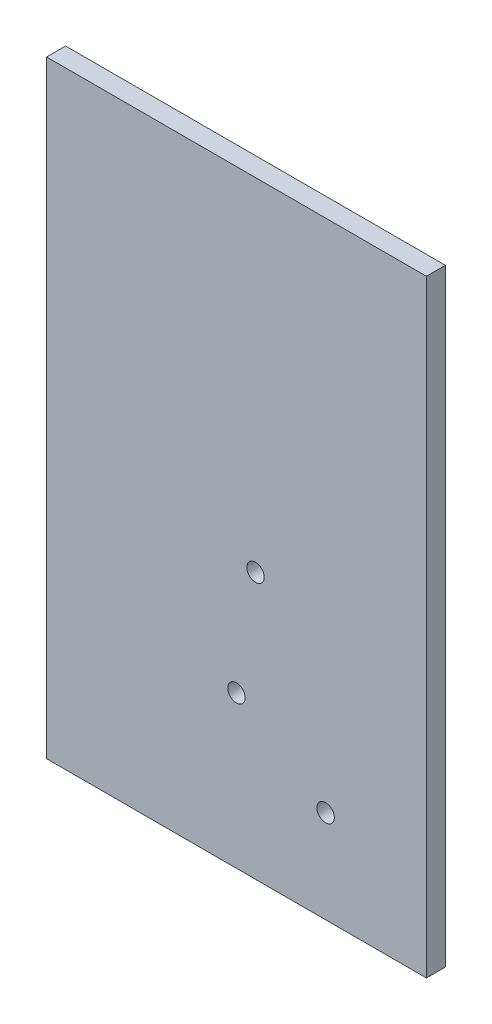
ISO-10303-21;
HEADER;
FILE_DESCRIPTION(('STEP AP214'),'2;1');
FILE_NAME('part.step','',(''),(''),'','','');
FILE_SCHEMA(('AUTOMOTIVE_DESIGN { 1 0 10303 214 1 1 1 1 }'));
ENDSEC;
DATA;
#1=APPLICATION_CONTEXT('core data for automotive mechanical design processes');
#2=APPLICATION_PROTOCOL_DEFINITION('international standard','automotive_design',2000,#1);
#3=PRODUCT_CONTEXT('',#1,'mechanical');
#4=PRODUCT('Part','Part','',(#3));
#5=PRODUCT_RELATED_PRODUCT_CATEGORY('part','',(#4));
#6=PRODUCT_DEFINITION_FORMATION('','',#4);
#7=PRODUCT_DEFINITION_CONTEXT('part definition',#1,'design');
#8=PRODUCT_DEFINITION('design','',#6,#7);
#9=PRODUCT_DEFINITION_SHAPE('','',#8);
#10=(LENGTH_UNIT() NAMED_UNIT(*) SI_UNIT(.MILLI.,.METRE.));
#11=(NAMED_UNIT(*) PLANE_ANGLE_UNIT() SI_UNIT($,.RADIAN.));
#12=(NAMED_UNIT(*) SI_UNIT($,.STERADIAN.) SOLID_ANGLE_UNIT());
#13=UNCERTAINTY_MEASURE_WITH_UNIT(LENGTH_MEASURE(1.E-05),#10,'distance_accuracy_value','');
#14=(GEOMETRIC_REPRESENTATION_CONTEXT(3) GLOBAL_UNCERTAINTY_ASSIGNED_CONTEXT((#13)) GLOBAL_UNIT_ASSIGNED_CONTEXT((#10,
#11,#12)) REPRESENTATION_CONTEXT('',''));
#15=CARTESIAN_POINT('',(0.,0.,0.));
#16=DIRECTION('',(0.,0.,1.));
#17=DIRECTION('',(1.,0.,0.));
#18=AXIS2_PLACEMENT_3D('',#15,#16,#17);
#19=CARTESIAN_POINT('',(62.8894230769231,0.,6.35));
#20=DIRECTION('',(1.,0.,0.));
#21=DIRECTION('',(0.,1.,0.));
#22=AXIS2_PLACEMENT_3D('',#19,#20,#21);
#23=PLANE('',#22);
#24=DIRECTION('',(0.,-1.,0.));
#25=VECTOR('',#24,1.);
#26=CARTESIAN_POINT('',(62.8894230769231,0.,0.));
#27=LINE('',#26,#25);
#28=CARTESIAN_POINT('',(62.8894230769231,38.8805866158279,0.));
#29=VERTEX_POINT('',#28);
#30=CARTESIAN_POINT('',(62.8894230769231,-164.319413384172,0.));
#31=VERTEX_POINT('',#30);
#32=EDGE_CURVE('E111',#29,#31,#27,.T.);
#33=ORIENTED_EDGE('',*,*,#32,.F.);
#34=DIRECTION('',(0.,0.,-1.));
#35=VECTOR('',#34,1.);
#36=CARTESIAN_POINT('',(62.8894230769231,38.8805866158279,6.35));
#37=LINE('',#36,#35);
#38=CARTESIAN_POINT('',(62.8894230769231,38.8805866158279,6.35));
#39=VERTEX_POINT('',#38);
#40=EDGE_CURVE('E11',#39,#29,#37,.T.);
#41=ORIENTED_EDGE('',*,*,#40,.F.);
#42=DIRECTION('',(0.,-1.,0.));
#43=VECTOR('',#42,1.);
#44=CARTESIAN_POINT('',(62.8894230769231,0.,6.35));
#45=LINE('',#44,#43);
#46=CARTESIAN_POINT('',(62.8894230769231,-164.319413384172,6.35));
#47=VERTEX_POINT('',#46);
#48=EDGE_CURVE('E95',#39,#47,#45,.T.);
#49=ORIENTED_EDGE('',*,*,#48,.T.);
#50=DIRECTION('',(0.,0.,-1.));
#51=VECTOR('',#50,1.);
#52=CARTESIAN_POINT('',(62.8894230769231,-164.319413384172,6.35));
#53=LINE('',#52,#51);
#54=EDGE_CURVE('E73',#47,#31,#53,.T.);
#55=ORIENTED_EDGE('',*,*,#54,.T.);
#56=EDGE_LOOP('',(#33,#41,#49,#55));
#57=FACE_BOUND('',#56,.T.);
#58=ADVANCED_FACE('F33',(#57),#23,.T.);
#59=CARTESIAN_POINT('',(0.,38.8805866158279,6.35));
#60=DIRECTION('',(0.,1.,0.));
#61=DIRECTION('',(0.,0.,1.));
#62=AXIS2_PLACEMENT_3D('',#59,#60,#61);
#63=PLANE('',#62);
#64=DIRECTION('',(1.,0.,0.));
#65=VECTOR('',#64,1.);
#66=CARTESIAN_POINT('',(0.,38.8805866158279,0.));
#67=LINE('',#66,#65);
#68=CARTESIAN_POINT('',(-64.1105769230769,38.8805866158279,0.));
#69=VERTEX_POINT('',#68);
#70=EDGE_CURVE('E85',#69,#29,#67,.T.);
#71=ORIENTED_EDGE('',*,*,#70,.F.);
#72=DIRECTION('',(0.,0.,-1.));
#73=VECTOR('',#72,1.);
#74=CARTESIAN_POINT('',(-64.1105769230769,38.8805866158279,6.35));
#75=LINE('',#74,#73);
#76=CARTESIAN_POINT('',(-64.1105769230769,38.8805866158279,6.35));
#77=VERTEX_POINT('',#76);
#78=EDGE_CURVE('E42',#77,#69,#75,.T.);
#79=ORIENTED_EDGE('',*,*,#78,.F.);
#80=DIRECTION('',(1.,0.,0.));
#81=VECTOR('',#80,1.);
#82=CARTESIAN_POINT('',(0.,38.8805866158279,6.35));
#83=LINE('',#82,#81);
#84=EDGE_CURVE('E83',#77,#39,#83,.T.);
#85=ORIENTED_EDGE('',*,*,#84,.T.);
#86=ORIENTED_EDGE('',*,*,#40,.T.);
#87=EDGE_LOOP('',(#71,#79,#85,#86));
#88=FACE_BOUND('',#87,.T.);
#89=ADVANCED_FACE('F81',(#88),#63,.T.);
#90=CARTESIAN_POINT('',(-64.1105769230769,0.,6.35));
#91=DIRECTION('',(1.,0.,0.));
#92=DIRECTION('',(0.,1.,0.));
#93=AXIS2_PLACEMENT_3D('',#90,#91,#92);
#94=PLANE('',#93);
#95=DIRECTION('',(0.,-1.,0.));
#96=VECTOR('',#95,1.);
#97=CARTESIAN_POINT('',(-64.1105769230769,0.,0.));
#98=LINE('',#97,#96);
#99=CARTESIAN_POINT('',(-64.1105769230769,-164.319413384172,0.));
#100=VERTEX_POINT('',#99);
#101=EDGE_CURVE('E114',#69,#100,#98,.T.);
#102=ORIENTED_EDGE('',*,*,#101,.T.);
#103=DIRECTION('',(0.,0.,-1.));
#104=VECTOR('',#103,1.);
#105=CARTESIAN_POINT('',(-64.1105769230769,-164.319413384172,6.35));
#106=LINE('',#105,#104);
#107=CARTESIAN_POINT('',(-64.1105769230769,-164.319413384172,6.35));
#108=VERTEX_POINT('',#107);
#109=EDGE_CURVE('E88',#108,#100,#106,.T.);
#110=ORIENTED_EDGE('',*,*,#109,.F.);
#111=DIRECTION('',(0.,-1.,0.));
#112=VECTOR('',#111,1.);
#113=CARTESIAN_POINT('',(-64.1105769230769,0.,6.35));
#114=LINE('',#113,#112);
#115=EDGE_CURVE('E90',#77,#108,#114,.T.);
#116=ORIENTED_EDGE('',*,*,#115,.F.);
#117=ORIENTED_EDGE('',*,*,#78,.T.);
#118=EDGE_LOOP('',(#102,#110,#116,#117));
#119=FACE_BOUND('',#118,.T.);
#120=ADVANCED_FACE('F91',(#119),#94,.F.);
#121=CARTESIAN_POINT('',(5.73942307692311,-75.4194133841721,6.35));
#122=DIRECTION('',(0.,0.,-1.));
#123=DIRECTION('',(-1.,0.,0.));
#124=AXIS2_PLACEMENT_3D('',#121,#122,#123);
#125=CYLINDRICAL_SURFACE('',#124,2.921);
#126=CARTESIAN_POINT('',(5.73942307692311,-75.4194133841721,6.35));
#127=DIRECTION('',(0.,0.,1.));
#128=DIRECTION('',(1.,0.,0.));
#129=AXIS2_PLACEMENT_3D('',#126,#127,#128);
#130=CIRCLE('',#129,2.921);
#131=CARTESIAN_POINT('',(8.66042307692311,-75.4194133841721,6.35));
#132=VERTEX_POINT('',#131);
#133=EDGE_CURVE('E102',#132,#132,#130,.T.);
#134=ORIENTED_EDGE('',*,*,#133,.T.);
#135=EDGE_LOOP('',(#134));
#136=FACE_BOUND('',#135,.T.);
#137=CARTESIAN_POINT('',(5.73942307692311,-75.4194133841721,0.));
#138=DIRECTION('',(0.,0.,1.));
#139=DIRECTION('',(1.,0.,0.));
#140=AXIS2_PLACEMENT_3D('',#137,#138,#139);
#141=CIRCLE('',#140,2.921);
#142=CARTESIAN_POINT('',(8.66042307692311,-75.4194133841721,0.));
#143=VERTEX_POINT('',#142);
#144=EDGE_CURVE('E117',#143,#143,#141,.T.);
#145=ORIENTED_EDGE('',*,*,#144,.F.);
#146=EDGE_LOOP('',(#145));
#147=FACE_BOUND('',#146,.T.);
#148=ADVANCED_FACE('F136',(#136,#147),#125,.F.);
#149=CARTESIAN_POINT('',(0.,-164.319413384172,6.35));
#150=DIRECTION('',(0.,1.,0.));
#151=DIRECTION('',(0.,0.,1.));
#152=AXIS2_PLACEMENT_3D('',#149,#150,#151);
#153=PLANE('',#152);
#154=DIRECTION('',(1.,0.,0.));
#155=VECTOR('',#154,1.);
#156=CARTESIAN_POINT('',(0.,-164.319413384172,0.));
#157=LINE('',#156,#155);
#158=EDGE_CURVE('E66',#100,#31,#157,.T.);
#159=ORIENTED_EDGE('',*,*,#158,.T.);
#160=ORIENTED_EDGE('',*,*,#54,.F.);
#161=DIRECTION('',(1.,0.,0.));
#162=VECTOR('',#161,1.);
#163=CARTESIAN_POINT('',(0.,-164.319413384172,6.35));
#164=LINE('',#163,#162);
#165=EDGE_CURVE('E50',#108,#47,#164,.T.);
#166=ORIENTED_EDGE('',*,*,#165,.F.);
#167=ORIENTED_EDGE('',*,*,#109,.T.);
#168=EDGE_LOOP('',(#159,#160,#166,#167));
#169=FACE_BOUND('',#168,.T.);
#170=ADVANCED_FACE('F125',(#169),#153,.F.);
#171=CARTESIAN_POINT('',(-0.610576923076887,-113.519413384172,6.35));
#172=DIRECTION('',(0.,0.,-1.));
#173=DIRECTION('',(-1.,0.,0.));
#174=AXIS2_PLACEMENT_3D('',#171,#172,#173);
#175=CYLINDRICAL_SURFACE('',#174,2.921);
#176=CARTESIAN_POINT('',(-0.610576923076887,-113.519413384172,6.35));
#177=DIRECTION('',(0.,0.,1.));
#178=DIRECTION('',(1.,0.,0.));
#179=AXIS2_PLACEMENT_3D('',#176,#177,#178);
#180=CIRCLE('',#179,2.921);
#181=CARTESIAN_POINT('',(2.31042307692311,-113.519413384172,6.35));
#182=VERTEX_POINT('',#181);
#183=EDGE_CURVE('E97',#182,#182,#180,.T.);
#184=ORIENTED_EDGE('',*,*,#183,.T.);
#185=EDGE_LOOP('',(#184));
#186=FACE_BOUND('',#185,.T.);
#187=CARTESIAN_POINT('',(-0.610576923076887,-113.519413384172,0.));
#188=DIRECTION('',(0.,0.,1.));
#189=DIRECTION('',(1.,0.,0.));
#190=AXIS2_PLACEMENT_3D('',#187,#188,#189);
#191=CIRCLE('',#190,2.921);
#192=CARTESIAN_POINT('',(2.31042307692311,-113.519413384172,0.));
#193=VERTEX_POINT('',#192);
#194=EDGE_CURVE('E108',#193,#193,#191,.T.);
#195=ORIENTED_EDGE('',*,*,#194,.F.);
#196=EDGE_LOOP('',(#195));
#197=FACE_BOUND('',#196,.T.);
#198=ADVANCED_FACE('F35',(#186,#197),#175,.F.);
#199=CARTESIAN_POINT('',(29.1820458886697,-133.308695889502,6.35));
#200=DIRECTION('',(0.,0.,-1.));
#201=DIRECTION('',(-1.,0.,0.));
#202=AXIS2_PLACEMENT_3D('',#199,#200,#201);
#203=CYLINDRICAL_SURFACE('',#202,2.921);
#204=CARTESIAN_POINT('',(29.1820458886697,-133.308695889502,6.35));
#205=DIRECTION('',(0.,0.,1.));
#206=DIRECTION('',(1.,0.,0.));
#207=AXIS2_PLACEMENT_3D('',#204,#205,#206);
#208=CIRCLE('',#207,2.921);
#209=CARTESIAN_POINT('',(32.1030458886697,-133.308695889502,6.35));
#210=VERTEX_POINT('',#209);
#211=EDGE_CURVE('E105',#210,#210,#208,.T.);
#212=ORIENTED_EDGE('',*,*,#211,.T.);
#213=EDGE_LOOP('',(#212));
#214=FACE_BOUND('',#213,.T.);
#215=CARTESIAN_POINT('',(29.1820458886697,-133.308695889502,0.));
#216=DIRECTION('',(0.,0.,1.));
#217=DIRECTION('',(1.,0.,0.));
#218=AXIS2_PLACEMENT_3D('',#215,#216,#217);
#219=CIRCLE('',#218,2.921);
#220=CARTESIAN_POINT('',(32.1030458886697,-133.308695889502,0.));
#221=VERTEX_POINT('',#220);
#222=EDGE_CURVE('E120',#221,#221,#219,.T.);
#223=ORIENTED_EDGE('',*,*,#222,.F.);
#224=EDGE_LOOP('',(#223));
#225=FACE_BOUND('',#224,.T.);
#226=ADVANCED_FACE('F142',(#214,#225),#203,.F.);
#227=CARTESIAN_POINT('',(0.,0.,6.35));
#228=DIRECTION('',(0.,0.,1.));
#229=DIRECTION('',(1.,0.,0.));
#230=AXIS2_PLACEMENT_3D('',#227,#228,#229);
#231=PLANE('',#230);
#232=ORIENTED_EDGE('',*,*,#183,.F.);
#233=EDGE_LOOP('',(#232));
#234=FACE_BOUND('',#233,.T.);
#235=ORIENTED_EDGE('',*,*,#48,.F.);
#236=ORIENTED_EDGE('',*,*,#84,.F.);
#237=ORIENTED_EDGE('',*,*,#115,.T.);
#238=ORIENTED_EDGE('',*,*,#165,.T.);
#239=EDGE_LOOP('',(#235,#236,#237,#238));
#240=FACE_BOUND('',#239,.T.);
#241=ORIENTED_EDGE('',*,*,#133,.F.);
#242=EDGE_LOOP('',(#241));
#243=FACE_BOUND('',#242,.T.);
#244=ORIENTED_EDGE('',*,*,#211,.F.);
#245=EDGE_LOOP('',(#244));
#246=FACE_BOUND('',#245,.T.);
#247=ADVANCED_FACE('F93',(#234,#240,#243,#246),#231,.T.);
#248=CARTESIAN_POINT('',(0.,0.,0.));
#249=DIRECTION('',(0.,0.,1.));
#250=DIRECTION('',(1.,0.,0.));
#251=AXIS2_PLACEMENT_3D('',#248,#249,#250);
#252=PLANE('',#251);
#253=ORIENTED_EDGE('',*,*,#194,.T.);
#254=EDGE_LOOP('',(#253));
#255=FACE_BOUND('',#254,.T.);
#256=ORIENTED_EDGE('',*,*,#32,.T.);
#257=ORIENTED_EDGE('',*,*,#158,.F.);
#258=ORIENTED_EDGE('',*,*,#101,.F.);
#259=ORIENTED_EDGE('',*,*,#70,.T.);
#260=EDGE_LOOP('',(#256,#257,#258,#259));
#261=FACE_BOUND('',#260,.T.);
#262=ORIENTED_EDGE('',*,*,#144,.T.);
#263=EDGE_LOOP('',(#262));
#264=FACE_BOUND('',#263,.T.);
#265=ORIENTED_EDGE('',*,*,#222,.T.);
#266=EDGE_LOOP('',(#265));
#267=FACE_BOUND('',#266,.T.);
#268=ADVANCED_FACE('F126',(#255,#261,#264,#267),#252,.F.);
#269=CLOSED_SHELL('',(#58,#89,#120,#148,#170,#198,#226,#247,#268));
#270=MANIFOLD_SOLID_BREP('B2',#269);
#271=ADVANCED_BREP_SHAPE_REPRESENTATION('',(#18,#270),#14);
#272=SHAPE_DEFINITION_REPRESENTATION(#9,#271);
ENDSEC;
END-ISO-10303-21;
